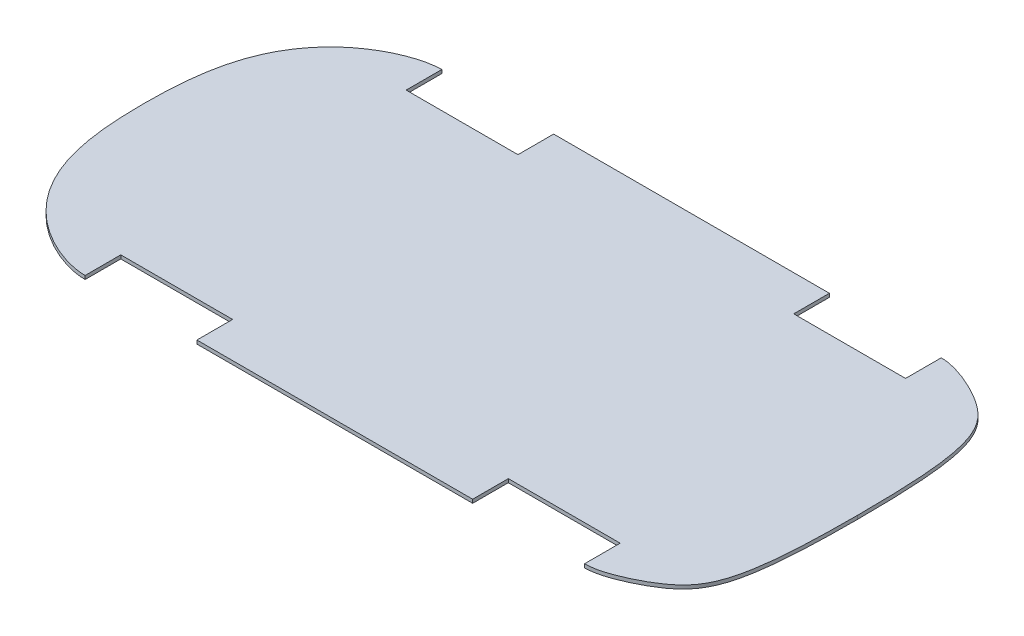
ISO-10303-21;
HEADER;
FILE_DESCRIPTION(('STEP AP214'),'2;1');
FILE_NAME('part.step','',(''),(''),'','','');
FILE_SCHEMA(('AUTOMOTIVE_DESIGN { 1 0 10303 214 1 1 1 1 }'));
ENDSEC;
DATA;
#1=APPLICATION_CONTEXT('core data for automotive mechanical design processes');
#2=APPLICATION_PROTOCOL_DEFINITION('international standard','automotive_design',2000,#1);
#3=PRODUCT_CONTEXT('',#1,'mechanical');
#4=PRODUCT('Part','Part','',(#3));
#5=PRODUCT_RELATED_PRODUCT_CATEGORY('part','',(#4));
#6=PRODUCT_DEFINITION_FORMATION('','',#4);
#7=PRODUCT_DEFINITION_CONTEXT('part definition',#1,'design');
#8=PRODUCT_DEFINITION('design','',#6,#7);
#9=PRODUCT_DEFINITION_SHAPE('','',#8);
#10=(LENGTH_UNIT() NAMED_UNIT(*) SI_UNIT(.MILLI.,.METRE.));
#11=(NAMED_UNIT(*) PLANE_ANGLE_UNIT() SI_UNIT($,.RADIAN.));
#12=(NAMED_UNIT(*) SI_UNIT($,.STERADIAN.) SOLID_ANGLE_UNIT());
#13=UNCERTAINTY_MEASURE_WITH_UNIT(LENGTH_MEASURE(1.E-05),#10,'distance_accuracy_value','');
#14=(GEOMETRIC_REPRESENTATION_CONTEXT(3) GLOBAL_UNCERTAINTY_ASSIGNED_CONTEXT((#13)) GLOBAL_UNIT_ASSIGNED_CONTEXT((#10,
#11,#12)) REPRESENTATION_CONTEXT('',''));
#15=CARTESIAN_POINT('',(0.,0.,0.));
#16=DIRECTION('',(0.,0.,1.));
#17=DIRECTION('',(1.,0.,0.));
#18=AXIS2_PLACEMENT_3D('',#15,#16,#17);
#19=CARTESIAN_POINT('',(1470.04897218709,20.,1000.00002169823));
#20=CARTESIAN_POINT('',(1607.72565016903,20.,1000.0000089803));
#21=CARTESIAN_POINT('',(1776.07388835532,20.,898.779172142014));
#22=CARTESIAN_POINT('',(1902.33506803637,20.,797.558335451434));
#23=CARTESIAN_POINT('',(2000.00004354946,20.,861.100021698231));
#24=CARTESIAN_POINT('',(2000.,20.,-7.49841092362893E-13));
#25=B_SPLINE_CURVE_WITH_KNOTS('',5,(#19,#20,#21,#22,#23,#24),.UNSPECIFIED.,.F.,.F.,(6,6),(0.,
1.),.UNSPECIFIED.);
#26=DIRECTION('',(0.,-1.,0.));
#27=VECTOR('',#26,1.);
#28=SURFACE_OF_LINEAR_EXTRUSION('',#25,#27);
#29=DIRECTION('',(0.,-1.,0.));
#30=VECTOR('',#29,1.);
#31=CARTESIAN_POINT('',(1470.04897218709,20.,1000.00002169823));
#32=LINE('',#31,#30);
#33=CARTESIAN_POINT('',(1470.04897218709,20.,1000.00002169823));
#34=VERTEX_POINT('',#33);
#35=CARTESIAN_POINT('',(1470.04897218709,-0.0001,1000.00002169823));
#36=VERTEX_POINT('',#35);
#37=EDGE_CURVE('E176',#34,#36,#32,.T.);
#38=ORIENTED_EDGE('',*,*,#37,.T.);
#39=CARTESIAN_POINT('',(1470.04897218709,-0.0001,1000.00002169823));
#40=CARTESIAN_POINT('',(1607.72565016903,-0.0001,1000.0000089803));
#41=CARTESIAN_POINT('',(1776.07388835532,-0.0001,898.779172142014));
#42=CARTESIAN_POINT('',(1902.33506803637,-0.0001,797.558335451434));
#43=CARTESIAN_POINT('',(2000.00004354946,-0.0001,861.100021698231));
#44=CARTESIAN_POINT('',(2000.,-0.0001,-7.49841092362893E-13));
#45=B_SPLINE_CURVE_WITH_KNOTS('',5,(#39,#40,#41,#42,#43,#44),.UNSPECIFIED.,.F.,.F.,(6,6),(0.,
1.),.UNSPECIFIED.);
#46=CARTESIAN_POINT('',(2000.,-0.0001,-7.49841092362893E-13));
#47=VERTEX_POINT('',#46);
#48=EDGE_CURVE('E170',#36,#47,#45,.T.);
#49=ORIENTED_EDGE('',*,*,#48,.T.);
#50=DIRECTION('',(0.,-1.,0.));
#51=VECTOR('',#50,1.);
#52=CARTESIAN_POINT('',(2000.,20.,-7.49841092362893E-13));
#53=LINE('',#52,#51);
#54=CARTESIAN_POINT('',(2000.,20.,-7.49841092362893E-13));
#55=VERTEX_POINT('',#54);
#56=EDGE_CURVE('E11',#55,#47,#53,.T.);
#57=ORIENTED_EDGE('',*,*,#56,.F.);
#58=EDGE_CURVE('E243',#34,#55,#25,.T.);
#59=ORIENTED_EDGE('',*,*,#58,.F.);
#60=EDGE_LOOP('',(#38,#49,#57,#59));
#61=FACE_BOUND('',#60,.T.);
#62=ADVANCED_FACE('F33',(#61),#28,.F.);
#63=CARTESIAN_POINT('',(2000.,20.,-7.49841092362893E-13));
#64=CARTESIAN_POINT('',(2000.00004354946,20.,-861.100021698232));
#65=CARTESIAN_POINT('',(1902.33506803637,20.,-797.558335451435));
#66=CARTESIAN_POINT('',(1776.07388835532,20.,-898.779172142016));
#67=CARTESIAN_POINT('',(1607.72565016903,20.,-1000.0000089803));
#68=CARTESIAN_POINT('',(1470.04897218709,20.,-1000.00002169823));
#69=B_SPLINE_CURVE_WITH_KNOTS('',5,(#63,#64,#65,#66,#67,#68),.UNSPECIFIED.,.F.,.F.,(6,6),(0.,
1.),.UNSPECIFIED.);
#70=DIRECTION('',(0.,-1.,0.));
#71=VECTOR('',#70,1.);
#72=SURFACE_OF_LINEAR_EXTRUSION('',#69,#71);
#73=ORIENTED_EDGE('',*,*,#56,.T.);
#74=CARTESIAN_POINT('',(2000.,-0.0001,-7.49841092362893E-13));
#75=CARTESIAN_POINT('',(2000.00004354946,-0.0001,-861.100021698232));
#76=CARTESIAN_POINT('',(1902.33506803637,-0.0001,-797.558335451435));
#77=CARTESIAN_POINT('',(1776.07388835532,-0.0001,-898.779172142016));
#78=CARTESIAN_POINT('',(1607.72565016903,-0.0001,-1000.0000089803));
#79=CARTESIAN_POINT('',(1470.04897218709,-0.0001,-1000.00002169823));
#80=B_SPLINE_CURVE_WITH_KNOTS('',5,(#74,#75,#76,#77,#78,#79),.UNSPECIFIED.,.F.,.F.,(6,6),(0.,
1.),.UNSPECIFIED.);
#81=CARTESIAN_POINT('',(1470.04897218709,-0.0001,-1000.00002169823));
#82=VERTEX_POINT('',#81);
#83=EDGE_CURVE('E160',#47,#82,#80,.T.);
#84=ORIENTED_EDGE('',*,*,#83,.T.);
#85=DIRECTION('',(0.,-1.,0.));
#86=VECTOR('',#85,1.);
#87=CARTESIAN_POINT('',(1470.04897218709,20.,-1000.00002169823));
#88=LINE('',#87,#86);
#89=CARTESIAN_POINT('',(1470.04897218709,20.,-1000.00002169823));
#90=VERTEX_POINT('',#89);
#91=EDGE_CURVE('E41',#90,#82,#88,.T.);
#92=ORIENTED_EDGE('',*,*,#91,.F.);
#93=EDGE_CURVE('E161',#55,#90,#69,.T.);
#94=ORIENTED_EDGE('',*,*,#93,.F.);
#95=EDGE_LOOP('',(#73,#84,#92,#94));
#96=FACE_BOUND('',#95,.T.);
#97=ADVANCED_FACE('F158',(#96),#72,.F.);
#98=CARTESIAN_POINT('',(1470.04897218709,20.,-800.000021698232));
#99=DIRECTION('',(1.,0.,0.));
#100=DIRECTION('',(0.,0.,-1.));
#101=AXIS2_PLACEMENT_3D('',#98,#99,#100);
#102=PLANE('',#101);
#103=ORIENTED_EDGE('',*,*,#91,.T.);
#104=DIRECTION('',(0.,0.,1.));
#105=VECTOR('',#104,1.);
#106=CARTESIAN_POINT('',(1470.04897218709,-0.0001,-800.000021698232));
#107=LINE('',#106,#105);
#108=CARTESIAN_POINT('',(1470.04897218709,-0.0001,-800.000021698232));
#109=VERTEX_POINT('',#108);
#110=EDGE_CURVE('E174',#82,#109,#107,.T.);
#111=ORIENTED_EDGE('',*,*,#110,.T.);
#112=DIRECTION('',(0.,-1.,0.));
#113=VECTOR('',#112,1.);
#114=CARTESIAN_POINT('',(1470.04897218709,20.,-800.000021698232));
#115=LINE('',#114,#113);
#116=CARTESIAN_POINT('',(1470.04897218709,20.,-800.000021698232));
#117=VERTEX_POINT('',#116);
#118=EDGE_CURVE('E357',#117,#109,#115,.T.);
#119=ORIENTED_EDGE('',*,*,#118,.F.);
#120=DIRECTION('',(0.,0.,1.));
#121=VECTOR('',#120,1.);
#122=CARTESIAN_POINT('',(1470.04897218709,20.,-800.000021698232));
#123=LINE('',#122,#121);
#124=EDGE_CURVE('E255',#90,#117,#123,.T.);
#125=ORIENTED_EDGE('',*,*,#124,.F.);
#126=EDGE_LOOP('',(#103,#111,#119,#125));
#127=FACE_BOUND('',#126,.T.);
#128=ADVANCED_FACE('F262',(#127),#102,.F.);
#129=CARTESIAN_POINT('',(843.048972187088,20.,-800.000021698232));
#130=DIRECTION('',(0.,0.,1.));
#131=DIRECTION('',(1.,0.,0.));
#132=AXIS2_PLACEMENT_3D('',#129,#130,#131);
#133=PLANE('',#132);
#134=ORIENTED_EDGE('',*,*,#118,.T.);
#135=DIRECTION('',(-1.,0.,0.));
#136=VECTOR('',#135,1.);
#137=CARTESIAN_POINT('',(843.048972187088,-0.0001,-800.000021698232));
#138=LINE('',#137,#136);
#139=CARTESIAN_POINT('',(843.048972187088,-0.0001,-800.000021698232));
#140=VERTEX_POINT('',#139);
#141=EDGE_CURVE('E190',#109,#140,#138,.T.);
#142=ORIENTED_EDGE('',*,*,#141,.T.);
#143=DIRECTION('',(0.,-1.,0.));
#144=VECTOR('',#143,1.);
#145=CARTESIAN_POINT('',(843.048972187088,20.,-800.000021698232));
#146=LINE('',#145,#144);
#147=CARTESIAN_POINT('',(843.048972187088,20.,-800.000021698232));
#148=VERTEX_POINT('',#147);
#149=EDGE_CURVE('E355',#148,#140,#146,.T.);
#150=ORIENTED_EDGE('',*,*,#149,.F.);
#151=DIRECTION('',(-1.,0.,0.));
#152=VECTOR('',#151,1.);
#153=CARTESIAN_POINT('',(843.048972187088,20.,-800.000021698232));
#154=LINE('',#153,#152);
#155=EDGE_CURVE('E361',#117,#148,#154,.T.);
#156=ORIENTED_EDGE('',*,*,#155,.F.);
#157=EDGE_LOOP('',(#134,#142,#150,#156));
#158=FACE_BOUND('',#157,.T.);
#159=ADVANCED_FACE('F265',(#158),#133,.F.);
#160=CARTESIAN_POINT('',(843.048972187088,20.,-1000.00002169823));
#161=DIRECTION('',(-1.,0.,0.));
#162=DIRECTION('',(0.,0.,1.));
#163=AXIS2_PLACEMENT_3D('',#160,#161,#162);
#164=PLANE('',#163);
#165=ORIENTED_EDGE('',*,*,#149,.T.);
#166=DIRECTION('',(0.,0.,-1.));
#167=VECTOR('',#166,1.);
#168=CARTESIAN_POINT('',(843.048972187088,-0.0001,-1000.00002169823));
#169=LINE('',#168,#167);
#170=CARTESIAN_POINT('',(843.048972187088,-0.0001,-1000.00002169823));
#171=VERTEX_POINT('',#170);
#172=EDGE_CURVE('E193',#140,#171,#169,.T.);
#173=ORIENTED_EDGE('',*,*,#172,.T.);
#174=DIRECTION('',(0.,-1.,0.));
#175=VECTOR('',#174,1.);
#176=CARTESIAN_POINT('',(843.048972187088,20.,-1000.00002169823));
#177=LINE('',#176,#175);
#178=CARTESIAN_POINT('',(843.048972187088,20.,-1000.00002169823));
#179=VERTEX_POINT('',#178);
#180=EDGE_CURVE('E353',#179,#171,#177,.T.);
#181=ORIENTED_EDGE('',*,*,#180,.F.);
#182=DIRECTION('',(0.,0.,-1.));
#183=VECTOR('',#182,1.);
#184=CARTESIAN_POINT('',(843.048972187088,20.,-1000.00002169823));
#185=LINE('',#184,#183);
#186=EDGE_CURVE('E362',#148,#179,#185,.T.);
#187=ORIENTED_EDGE('',*,*,#186,.F.);
#188=EDGE_LOOP('',(#165,#173,#181,#187));
#189=FACE_BOUND('',#188,.T.);
#190=ADVANCED_FACE('F269',(#189),#164,.F.);
#191=CARTESIAN_POINT('',(-702.951027812912,20.,-1000.00002169823));
#192=DIRECTION('',(0.,0.,1.));
#193=DIRECTION('',(1.,0.,0.));
#194=AXIS2_PLACEMENT_3D('',#191,#192,#193);
#195=PLANE('',#194);
#196=ORIENTED_EDGE('',*,*,#180,.T.);
#197=DIRECTION('',(-1.,0.,0.));
#198=VECTOR('',#197,1.);
#199=CARTESIAN_POINT('',(-702.951027812912,-0.0001,-1000.00002169823));
#200=LINE('',#199,#198);
#201=CARTESIAN_POINT('',(-702.951027812912,-0.0001,-1000.00002169823));
#202=VERTEX_POINT('',#201);
#203=EDGE_CURVE('E196',#171,#202,#200,.T.);
#204=ORIENTED_EDGE('',*,*,#203,.T.);
#205=DIRECTION('',(0.,-1.,0.));
#206=VECTOR('',#205,1.);
#207=CARTESIAN_POINT('',(-702.951027812912,20.,-1000.00002169823));
#208=LINE('',#207,#206);
#209=CARTESIAN_POINT('',(-702.951027812912,20.,-1000.00002169823));
#210=VERTEX_POINT('',#209);
#211=EDGE_CURVE('E351',#210,#202,#208,.T.);
#212=ORIENTED_EDGE('',*,*,#211,.F.);
#213=DIRECTION('',(-1.,0.,0.));
#214=VECTOR('',#213,1.);
#215=CARTESIAN_POINT('',(-702.951027812912,20.,-1000.00002169823));
#216=LINE('',#215,#214);
#217=EDGE_CURVE('E364',#179,#210,#216,.T.);
#218=ORIENTED_EDGE('',*,*,#217,.F.);
#219=EDGE_LOOP('',(#196,#204,#212,#218));
#220=FACE_BOUND('',#219,.T.);
#221=ADVANCED_FACE('F273',(#220),#195,.F.);
#222=CARTESIAN_POINT('',(-702.951027812912,20.,-800.000021698232));
#223=DIRECTION('',(1.,0.,0.));
#224=DIRECTION('',(0.,0.,-1.));
#225=AXIS2_PLACEMENT_3D('',#222,#223,#224);
#226=PLANE('',#225);
#227=ORIENTED_EDGE('',*,*,#211,.T.);
#228=DIRECTION('',(0.,0.,1.));
#229=VECTOR('',#228,1.);
#230=CARTESIAN_POINT('',(-702.951027812912,-0.0001,-800.000021698232));
#231=LINE('',#230,#229);
#232=CARTESIAN_POINT('',(-702.951027812912,-0.0001,-800.000021698232));
#233=VERTEX_POINT('',#232);
#234=EDGE_CURVE('E199',#202,#233,#231,.T.);
#235=ORIENTED_EDGE('',*,*,#234,.T.);
#236=DIRECTION('',(0.,-1.,0.));
#237=VECTOR('',#236,1.);
#238=CARTESIAN_POINT('',(-702.951027812912,20.,-800.000021698232));
#239=LINE('',#238,#237);
#240=CARTESIAN_POINT('',(-702.951027812912,20.,-800.000021698232));
#241=VERTEX_POINT('',#240);
#242=EDGE_CURVE('E349',#241,#233,#239,.T.);
#243=ORIENTED_EDGE('',*,*,#242,.F.);
#244=DIRECTION('',(0.,0.,1.));
#245=VECTOR('',#244,1.);
#246=CARTESIAN_POINT('',(-702.951027812912,20.,-800.000021698232));
#247=LINE('',#246,#245);
#248=EDGE_CURVE('E368',#210,#241,#247,.T.);
#249=ORIENTED_EDGE('',*,*,#248,.F.);
#250=EDGE_LOOP('',(#227,#235,#243,#249));
#251=FACE_BOUND('',#250,.T.);
#252=ADVANCED_FACE('F277',(#251),#226,.F.);
#253=CARTESIAN_POINT('',(-1329.95102781291,20.,-800.000021698232));
#254=DIRECTION('',(0.,0.,1.));
#255=DIRECTION('',(1.,0.,0.));
#256=AXIS2_PLACEMENT_3D('',#253,#254,#255);
#257=PLANE('',#256);
#258=ORIENTED_EDGE('',*,*,#242,.T.);
#259=DIRECTION('',(-1.,0.,0.));
#260=VECTOR('',#259,1.);
#261=CARTESIAN_POINT('',(-1329.95102781291,-0.0001,-800.000021698232));
#262=LINE('',#261,#260);
#263=CARTESIAN_POINT('',(-1329.95102781291,-0.0001,-800.000021698232));
#264=VERTEX_POINT('',#263);
#265=EDGE_CURVE('E202',#233,#264,#262,.T.);
#266=ORIENTED_EDGE('',*,*,#265,.T.);
#267=DIRECTION('',(0.,-1.,0.));
#268=VECTOR('',#267,1.);
#269=CARTESIAN_POINT('',(-1329.95102781291,20.,-800.000021698232));
#270=LINE('',#269,#268);
#271=CARTESIAN_POINT('',(-1329.95102781291,20.,-800.000021698232));
#272=VERTEX_POINT('',#271);
#273=EDGE_CURVE('E347',#272,#264,#270,.T.);
#274=ORIENTED_EDGE('',*,*,#273,.F.);
#275=DIRECTION('',(-1.,0.,0.));
#276=VECTOR('',#275,1.);
#277=CARTESIAN_POINT('',(-1329.95102781291,20.,-800.000021698232));
#278=LINE('',#277,#276);
#279=EDGE_CURVE('E369',#241,#272,#278,.T.);
#280=ORIENTED_EDGE('',*,*,#279,.F.);
#281=EDGE_LOOP('',(#258,#266,#274,#280));
#282=FACE_BOUND('',#281,.T.);
#283=ADVANCED_FACE('F281',(#282),#257,.F.);
#284=CARTESIAN_POINT('',(-1329.95102781291,20.,-1000.00002169823));
#285=DIRECTION('',(-1.,0.,0.));
#286=DIRECTION('',(0.,0.,1.));
#287=AXIS2_PLACEMENT_3D('',#284,#285,#286);
#288=PLANE('',#287);
#289=ORIENTED_EDGE('',*,*,#273,.T.);
#290=DIRECTION('',(0.,0.,-1.));
#291=VECTOR('',#290,1.);
#292=CARTESIAN_POINT('',(-1329.95102781291,-0.0001,-1000.00002169823));
#293=LINE('',#292,#291);
#294=CARTESIAN_POINT('',(-1329.95102781291,-0.0001,-1000.00002169823));
#295=VERTEX_POINT('',#294);
#296=EDGE_CURVE('E205',#264,#295,#293,.T.);
#297=ORIENTED_EDGE('',*,*,#296,.T.);
#298=DIRECTION('',(0.,-1.,0.));
#299=VECTOR('',#298,1.);
#300=CARTESIAN_POINT('',(-1329.95102781291,20.,-1000.00002169823));
#301=LINE('',#300,#299);
#302=CARTESIAN_POINT('',(-1329.95102781291,20.,-1000.00002169823));
#303=VERTEX_POINT('',#302);
#304=EDGE_CURVE('E345',#303,#295,#301,.T.);
#305=ORIENTED_EDGE('',*,*,#304,.F.);
#306=DIRECTION('',(0.,0.,-1.));
#307=VECTOR('',#306,1.);
#308=CARTESIAN_POINT('',(-1329.95102781291,20.,-1000.00002169823));
#309=LINE('',#308,#307);
#310=EDGE_CURVE('E304',#272,#303,#309,.T.);
#311=ORIENTED_EDGE('',*,*,#310,.F.);
#312=EDGE_LOOP('',(#289,#297,#305,#311));
#313=FACE_BOUND('',#312,.T.);
#314=ADVANCED_FACE('F285',(#313),#288,.F.);
#315=CARTESIAN_POINT('',(-1329.95102781291,20.,-1000.00002169823));
#316=CARTESIAN_POINT('',(-1481.46449430946,20.,-1000.00004432143));
#317=CARTESIAN_POINT('',(-1750.82167957359,20.,-890.149892656102));
#318=CARTESIAN_POINT('',(-1927.58733268781,20.,-679.714589853758));
#319=CARTESIAN_POINT('',(-2000.00004067059,20.,-444.027050350482));
#320=CARTESIAN_POINT('',(-2000.,20.,4.7480570678446E-13));
#321=B_SPLINE_CURVE_WITH_KNOTS('',5,(#315,#316,#317,#318,#319,#320),.UNSPECIFIED.,.F.,.F.,(6,6),
(0.,1.),.UNSPECIFIED.);
#322=DIRECTION('',(0.,-1.,0.));
#323=VECTOR('',#322,1.);
#324=SURFACE_OF_LINEAR_EXTRUSION('',#321,#323);
#325=ORIENTED_EDGE('',*,*,#304,.T.);
#326=CARTESIAN_POINT('',(-1329.95102781291,-0.0001,-1000.00002169823));
#327=CARTESIAN_POINT('',(-1481.46449430946,-0.0001,-1000.00004432143));
#328=CARTESIAN_POINT('',(-1750.82167957359,-0.0001,-890.149892656102));
#329=CARTESIAN_POINT('',(-1927.58733268781,-0.0001,-679.714589853758));
#330=CARTESIAN_POINT('',(-2000.00004067059,-0.0001,-444.027050350482));
#331=CARTESIAN_POINT('',(-2000.,-0.0001,4.7480570678446E-13));
#332=B_SPLINE_CURVE_WITH_KNOTS('',5,(#326,#327,#328,#329,#330,#331),.UNSPECIFIED.,.F.,.F.,(6,6),
(0.,1.),.UNSPECIFIED.);
#333=CARTESIAN_POINT('',(-2000.,-0.0001,4.7480570678446E-13));
#334=VERTEX_POINT('',#333);
#335=EDGE_CURVE('E208',#295,#334,#332,.T.);
#336=ORIENTED_EDGE('',*,*,#335,.T.);
#337=DIRECTION('',(0.,-1.,0.));
#338=VECTOR('',#337,1.);
#339=CARTESIAN_POINT('',(-2000.,20.,4.7480570678446E-13));
#340=LINE('',#339,#338);
#341=CARTESIAN_POINT('',(-2000.,20.,4.7480570678446E-13));
#342=VERTEX_POINT('',#341);
#343=EDGE_CURVE('E343',#342,#334,#340,.T.);
#344=ORIENTED_EDGE('',*,*,#343,.F.);
#345=EDGE_CURVE('E298',#303,#342,#321,.T.);
#346=ORIENTED_EDGE('',*,*,#345,.F.);
#347=EDGE_LOOP('',(#325,#336,#344,#346));
#348=FACE_BOUND('',#347,.T.);
#349=ADVANCED_FACE('F289',(#348),#324,.F.);
#350=CARTESIAN_POINT('',(-2000.,20.,4.7480570678446E-13));
#351=CARTESIAN_POINT('',(-2000.00004067059,20.,444.027050350483));
#352=CARTESIAN_POINT('',(-1927.58733268781,20.,679.714589853759));
#353=CARTESIAN_POINT('',(-1750.82167957359,20.,890.149892656103));
#354=CARTESIAN_POINT('',(-1481.46449430946,20.,1000.00004432143));
#355=CARTESIAN_POINT('',(-1329.95102781291,20.,1000.00002169823));
#356=B_SPLINE_CURVE_WITH_KNOTS('',5,(#350,#351,#352,#353,#354,#355),.UNSPECIFIED.,.F.,.F.,(6,6),
(0.,1.),.UNSPECIFIED.);
#357=DIRECTION('',(0.,-1.,0.));
#358=VECTOR('',#357,1.);
#359=SURFACE_OF_LINEAR_EXTRUSION('',#356,#358);
#360=ORIENTED_EDGE('',*,*,#343,.T.);
#361=CARTESIAN_POINT('',(-2000.,-0.0001,4.7480570678446E-13));
#362=CARTESIAN_POINT('',(-2000.00004067059,-0.0001,444.027050350483));
#363=CARTESIAN_POINT('',(-1927.58733268781,-0.0001,679.714589853759));
#364=CARTESIAN_POINT('',(-1750.82167957359,-0.0001,890.149892656103));
#365=CARTESIAN_POINT('',(-1481.46449430946,-0.0001,1000.00004432143));
#366=CARTESIAN_POINT('',(-1329.95102781291,-0.0001,1000.00002169823));
#367=B_SPLINE_CURVE_WITH_KNOTS('',5,(#361,#362,#363,#364,#365,#366),.UNSPECIFIED.,.F.,.F.,(6,6),
(0.,1.),.UNSPECIFIED.);
#368=CARTESIAN_POINT('',(-1329.95102781291,-0.0001,1000.00002169823));
#369=VERTEX_POINT('',#368);
#370=EDGE_CURVE('E213',#334,#369,#367,.T.);
#371=ORIENTED_EDGE('',*,*,#370,.T.);
#372=DIRECTION('',(0.,-1.,0.));
#373=VECTOR('',#372,1.);
#374=CARTESIAN_POINT('',(-1329.95102781291,20.,1000.00002169823));
#375=LINE('',#374,#373);
#376=CARTESIAN_POINT('',(-1329.95102781291,20.,1000.00002169823));
#377=VERTEX_POINT('',#376);
#378=EDGE_CURVE('E341',#377,#369,#375,.T.);
#379=ORIENTED_EDGE('',*,*,#378,.F.);
#380=EDGE_CURVE('E303',#342,#377,#356,.T.);
#381=ORIENTED_EDGE('',*,*,#380,.F.);
#382=EDGE_LOOP('',(#360,#371,#379,#381));
#383=FACE_BOUND('',#382,.T.);
#384=ADVANCED_FACE('F294',(#383),#359,.F.);
#385=CARTESIAN_POINT('',(-1329.95102781291,20.,1000.00002169823));
#386=DIRECTION('',(-1.,0.,0.));
#387=DIRECTION('',(0.,0.,1.));
#388=AXIS2_PLACEMENT_3D('',#385,#386,#387);
#389=PLANE('',#388);
#390=ORIENTED_EDGE('',*,*,#378,.T.);
#391=DIRECTION('',(0.,0.,-1.));
#392=VECTOR('',#391,1.);
#393=CARTESIAN_POINT('',(-1329.95102781291,-0.0001,1000.00002169823));
#394=LINE('',#393,#392);
#395=CARTESIAN_POINT('',(-1329.95102781291,-0.0001,800.000021698233));
#396=VERTEX_POINT('',#395);
#397=EDGE_CURVE('E221',#369,#396,#394,.T.);
#398=ORIENTED_EDGE('',*,*,#397,.T.);
#399=DIRECTION('',(0.,-1.,0.));
#400=VECTOR('',#399,1.);
#401=CARTESIAN_POINT('',(-1329.95102781291,20.,800.000021698233));
#402=LINE('',#401,#400);
#403=CARTESIAN_POINT('',(-1329.95102781291,20.,800.000021698233));
#404=VERTEX_POINT('',#403);
#405=EDGE_CURVE('E339',#404,#396,#402,.T.);
#406=ORIENTED_EDGE('',*,*,#405,.F.);
#407=DIRECTION('',(0.,0.,-1.));
#408=VECTOR('',#407,1.);
#409=CARTESIAN_POINT('',(-1329.95102781291,20.,1000.00002169823));
#410=LINE('',#409,#408);
#411=EDGE_CURVE('E313',#377,#404,#410,.T.);
#412=ORIENTED_EDGE('',*,*,#411,.F.);
#413=EDGE_LOOP('',(#390,#398,#406,#412));
#414=FACE_BOUND('',#413,.T.);
#415=ADVANCED_FACE('F388',(#414),#389,.F.);
#416=CARTESIAN_POINT('',(-1329.95102781291,20.,800.000021698233));
#417=DIRECTION('',(0.,0.,-1.));
#418=DIRECTION('',(-1.,0.,0.));
#419=AXIS2_PLACEMENT_3D('',#416,#417,#418);
#420=PLANE('',#419);
#421=ORIENTED_EDGE('',*,*,#405,.T.);
#422=DIRECTION('',(1.,0.,0.));
#423=VECTOR('',#422,1.);
#424=CARTESIAN_POINT('',(-1329.95102781291,-0.0001,800.000021698233));
#425=LINE('',#424,#423);
#426=CARTESIAN_POINT('',(-702.951027812911,-0.0001,800.000021698232));
#427=VERTEX_POINT('',#426);
#428=EDGE_CURVE('E227',#396,#427,#425,.T.);
#429=ORIENTED_EDGE('',*,*,#428,.T.);
#430=DIRECTION('',(0.,-1.,0.));
#431=VECTOR('',#430,1.);
#432=CARTESIAN_POINT('',(-702.951027812911,20.,800.000021698232));
#433=LINE('',#432,#431);
#434=CARTESIAN_POINT('',(-702.951027812911,20.,800.000021698232));
#435=VERTEX_POINT('',#434);
#436=EDGE_CURVE('E337',#435,#427,#433,.T.);
#437=ORIENTED_EDGE('',*,*,#436,.F.);
#438=DIRECTION('',(1.,0.,0.));
#439=VECTOR('',#438,1.);
#440=CARTESIAN_POINT('',(-1329.95102781291,20.,800.000021698233));
#441=LINE('',#440,#439);
#442=EDGE_CURVE('E318',#404,#435,#441,.T.);
#443=ORIENTED_EDGE('',*,*,#442,.F.);
#444=EDGE_LOOP('',(#421,#429,#437,#443));
#445=FACE_BOUND('',#444,.T.);
#446=ADVANCED_FACE('F392',(#445),#420,.F.);
#447=CARTESIAN_POINT('',(-702.951027812911,20.,800.000021698232));
#448=DIRECTION('',(1.,0.,0.));
#449=DIRECTION('',(0.,0.,-1.));
#450=AXIS2_PLACEMENT_3D('',#447,#448,#449);
#451=PLANE('',#450);
#452=ORIENTED_EDGE('',*,*,#436,.T.);
#453=DIRECTION('',(0.,0.,1.));
#454=VECTOR('',#453,1.);
#455=CARTESIAN_POINT('',(-702.951027812911,-0.0001,800.000021698232));
#456=LINE('',#455,#454);
#457=CARTESIAN_POINT('',(-702.951027812911,-0.0001,1000.00002169823));
#458=VERTEX_POINT('',#457);
#459=EDGE_CURVE('E230',#427,#458,#456,.T.);
#460=ORIENTED_EDGE('',*,*,#459,.T.);
#461=DIRECTION('',(0.,-1.,0.));
#462=VECTOR('',#461,1.);
#463=CARTESIAN_POINT('',(-702.951027812911,20.,1000.00002169823));
#464=LINE('',#463,#462);
#465=CARTESIAN_POINT('',(-702.951027812911,20.,1000.00002169823));
#466=VERTEX_POINT('',#465);
#467=EDGE_CURVE('E335',#466,#458,#464,.T.);
#468=ORIENTED_EDGE('',*,*,#467,.F.);
#469=DIRECTION('',(0.,0.,1.));
#470=VECTOR('',#469,1.);
#471=CARTESIAN_POINT('',(-702.951027812911,20.,800.000021698232));
#472=LINE('',#471,#470);
#473=EDGE_CURVE('E320',#435,#466,#472,.T.);
#474=ORIENTED_EDGE('',*,*,#473,.F.);
#475=EDGE_LOOP('',(#452,#460,#468,#474));
#476=FACE_BOUND('',#475,.T.);
#477=ADVANCED_FACE('F397',(#476),#451,.F.);
#478=CARTESIAN_POINT('',(-702.951027812911,20.,1000.00002169823));
#479=DIRECTION('',(0.,0.,-1.));
#480=DIRECTION('',(-1.,0.,0.));
#481=AXIS2_PLACEMENT_3D('',#478,#479,#480);
#482=PLANE('',#481);
#483=ORIENTED_EDGE('',*,*,#467,.T.);
#484=DIRECTION('',(1.,0.,0.));
#485=VECTOR('',#484,1.);
#486=CARTESIAN_POINT('',(-702.951027812911,-0.0001,1000.00002169823));
#487=LINE('',#486,#485);
#488=CARTESIAN_POINT('',(843.048972187088,-0.0001,1000.00002169823));
#489=VERTEX_POINT('',#488);
#490=EDGE_CURVE('E233',#458,#489,#487,.T.);
#491=ORIENTED_EDGE('',*,*,#490,.T.);
#492=DIRECTION('',(0.,-1.,0.));
#493=VECTOR('',#492,1.);
#494=CARTESIAN_POINT('',(843.048972187088,20.,1000.00002169823));
#495=LINE('',#494,#493);
#496=CARTESIAN_POINT('',(843.048972187088,20.,1000.00002169823));
#497=VERTEX_POINT('',#496);
#498=EDGE_CURVE('E333',#497,#489,#495,.T.);
#499=ORIENTED_EDGE('',*,*,#498,.F.);
#500=DIRECTION('',(1.,0.,0.));
#501=VECTOR('',#500,1.);
#502=CARTESIAN_POINT('',(-702.951027812911,20.,1000.00002169823));
#503=LINE('',#502,#501);
#504=EDGE_CURVE('E322',#466,#497,#503,.T.);
#505=ORIENTED_EDGE('',*,*,#504,.F.);
#506=EDGE_LOOP('',(#483,#491,#499,#505));
#507=FACE_BOUND('',#506,.T.);
#508=ADVANCED_FACE('F403',(#507),#482,.F.);
#509=CARTESIAN_POINT('',(843.048972187088,20.,1000.00002169823));
#510=DIRECTION('',(-1.,0.,0.));
#511=DIRECTION('',(0.,0.,1.));
#512=AXIS2_PLACEMENT_3D('',#509,#510,#511);
#513=PLANE('',#512);
#514=ORIENTED_EDGE('',*,*,#498,.T.);
#515=DIRECTION('',(0.,0.,-1.));
#516=VECTOR('',#515,1.);
#517=CARTESIAN_POINT('',(843.048972187088,-0.0001,1000.00002169823));
#518=LINE('',#517,#516);
#519=CARTESIAN_POINT('',(843.048972187088,-0.0001,800.000021698231));
#520=VERTEX_POINT('',#519);
#521=EDGE_CURVE('E236',#489,#520,#518,.T.);
#522=ORIENTED_EDGE('',*,*,#521,.T.);
#523=DIRECTION('',(0.,-1.,0.));
#524=VECTOR('',#523,1.);
#525=CARTESIAN_POINT('',(843.048972187088,20.,800.000021698231));
#526=LINE('',#525,#524);
#527=CARTESIAN_POINT('',(843.048972187088,20.,800.000021698231));
#528=VERTEX_POINT('',#527);
#529=EDGE_CURVE('E331',#528,#520,#526,.T.);
#530=ORIENTED_EDGE('',*,*,#529,.F.);
#531=DIRECTION('',(0.,0.,-1.));
#532=VECTOR('',#531,1.);
#533=CARTESIAN_POINT('',(843.048972187088,20.,1000.00002169823));
#534=LINE('',#533,#532);
#535=EDGE_CURVE('E324',#497,#528,#534,.T.);
#536=ORIENTED_EDGE('',*,*,#535,.F.);
#537=EDGE_LOOP('',(#514,#522,#530,#536));
#538=FACE_BOUND('',#537,.T.);
#539=ADVANCED_FACE('F407',(#538),#513,.F.);
#540=CARTESIAN_POINT('',(843.048972187088,20.,800.000021698231));
#541=DIRECTION('',(0.,0.,-1.));
#542=DIRECTION('',(-1.,0.,0.));
#543=AXIS2_PLACEMENT_3D('',#540,#541,#542);
#544=PLANE('',#543);
#545=ORIENTED_EDGE('',*,*,#529,.T.);
#546=DIRECTION('',(1.,0.,0.));
#547=VECTOR('',#546,1.);
#548=CARTESIAN_POINT('',(843.048972187088,-0.0001,800.000021698231));
#549=LINE('',#548,#547);
#550=CARTESIAN_POINT('',(1470.04897218709,-0.0001,800.000021698231));
#551=VERTEX_POINT('',#550);
#552=EDGE_CURVE('E239',#520,#551,#549,.T.);
#553=ORIENTED_EDGE('',*,*,#552,.T.);
#554=DIRECTION('',(0.,-1.,0.));
#555=VECTOR('',#554,1.);
#556=CARTESIAN_POINT('',(1470.04897218709,20.,800.000021698231));
#557=LINE('',#556,#555);
#558=CARTESIAN_POINT('',(1470.04897218709,20.,800.000021698231));
#559=VERTEX_POINT('',#558);
#560=EDGE_CURVE('E329',#559,#551,#557,.T.);
#561=ORIENTED_EDGE('',*,*,#560,.F.);
#562=DIRECTION('',(1.,0.,0.));
#563=VECTOR('',#562,1.);
#564=CARTESIAN_POINT('',(843.048972187088,20.,800.000021698231));
#565=LINE('',#564,#563);
#566=EDGE_CURVE('E53',#528,#559,#565,.T.);
#567=ORIENTED_EDGE('',*,*,#566,.F.);
#568=EDGE_LOOP('',(#545,#553,#561,#567));
#569=FACE_BOUND('',#568,.T.);
#570=ADVANCED_FACE('F410',(#569),#544,.F.);
#571=CARTESIAN_POINT('',(1470.04897218709,20.,800.000021698231));
#572=DIRECTION('',(1.,0.,0.));
#573=DIRECTION('',(0.,0.,-1.));
#574=AXIS2_PLACEMENT_3D('',#571,#572,#573);
#575=PLANE('',#574);
#576=ORIENTED_EDGE('',*,*,#560,.T.);
#577=DIRECTION('',(0.,0.,1.));
#578=VECTOR('',#577,1.);
#579=CARTESIAN_POINT('',(1470.04897218709,-0.0001,800.000021698231));
#580=LINE('',#579,#578);
#581=EDGE_CURVE('E242',#551,#36,#580,.T.);
#582=ORIENTED_EDGE('',*,*,#581,.T.);
#583=ORIENTED_EDGE('',*,*,#37,.F.);
#584=DIRECTION('',(0.,0.,1.));
#585=VECTOR('',#584,1.);
#586=CARTESIAN_POINT('',(1470.04897218709,20.,800.000021698231));
#587=LINE('',#586,#585);
#588=EDGE_CURVE('E48',#559,#34,#587,.T.);
#589=ORIENTED_EDGE('',*,*,#588,.F.);
#590=EDGE_LOOP('',(#576,#582,#583,#589));
#591=FACE_BOUND('',#590,.T.);
#592=ADVANCED_FACE('F412',(#591),#575,.F.);
#593=CARTESIAN_POINT('',(1821.64896889676,20.,852.152351594542));
#594=DIRECTION('',(0.,-1.,0.));
#595=DIRECTION('',(0.,0.,-1.));
#596=AXIS2_PLACEMENT_3D('',#593,#594,#595);
#597=PLANE('',#596);
#598=ORIENTED_EDGE('',*,*,#58,.T.);
#599=ORIENTED_EDGE('',*,*,#93,.T.);
#600=ORIENTED_EDGE('',*,*,#124,.T.);
#601=ORIENTED_EDGE('',*,*,#155,.T.);
#602=ORIENTED_EDGE('',*,*,#186,.T.);
#603=ORIENTED_EDGE('',*,*,#217,.T.);
#604=ORIENTED_EDGE('',*,*,#248,.T.);
#605=ORIENTED_EDGE('',*,*,#279,.T.);
#606=ORIENTED_EDGE('',*,*,#310,.T.);
#607=ORIENTED_EDGE('',*,*,#345,.T.);
#608=ORIENTED_EDGE('',*,*,#380,.T.);
#609=ORIENTED_EDGE('',*,*,#411,.T.);
#610=ORIENTED_EDGE('',*,*,#442,.T.);
#611=ORIENTED_EDGE('',*,*,#473,.T.);
#612=ORIENTED_EDGE('',*,*,#504,.T.);
#613=ORIENTED_EDGE('',*,*,#535,.T.);
#614=ORIENTED_EDGE('',*,*,#566,.T.);
#615=ORIENTED_EDGE('',*,*,#588,.T.);
#616=EDGE_LOOP('',(#598,#599,#600,#601,#602,#603,#604,#605,#606,#607,#608,#609,#610,#611,#612,
#613,#614,#615));
#617=FACE_BOUND('',#616,.T.);
#618=ADVANCED_FACE('F374',(#617),#597,.F.);
#619=CARTESIAN_POINT('',(1821.64896889676,-0.0001,852.152351594542));
#620=DIRECTION('',(0.,-1.,0.));
#621=DIRECTION('',(0.,0.,-1.));
#622=AXIS2_PLACEMENT_3D('',#619,#620,#621);
#623=PLANE('',#622);
#624=ORIENTED_EDGE('',*,*,#48,.F.);
#625=ORIENTED_EDGE('',*,*,#581,.F.);
#626=ORIENTED_EDGE('',*,*,#552,.F.);
#627=ORIENTED_EDGE('',*,*,#521,.F.);
#628=ORIENTED_EDGE('',*,*,#490,.F.);
#629=ORIENTED_EDGE('',*,*,#459,.F.);
#630=ORIENTED_EDGE('',*,*,#428,.F.);
#631=ORIENTED_EDGE('',*,*,#397,.F.);
#632=ORIENTED_EDGE('',*,*,#370,.F.);
#633=ORIENTED_EDGE('',*,*,#335,.F.);
#634=ORIENTED_EDGE('',*,*,#296,.F.);
#635=ORIENTED_EDGE('',*,*,#265,.F.);
#636=ORIENTED_EDGE('',*,*,#234,.F.);
#637=ORIENTED_EDGE('',*,*,#203,.F.);
#638=ORIENTED_EDGE('',*,*,#172,.F.);
#639=ORIENTED_EDGE('',*,*,#141,.F.);
#640=ORIENTED_EDGE('',*,*,#110,.F.);
#641=ORIENTED_EDGE('',*,*,#83,.F.);
#642=EDGE_LOOP('',(#624,#625,#626,#627,#628,#629,#630,#631,#632,#633,#634,#635,#636,#637,#638,
#639,#640,#641));
#643=FACE_BOUND('',#642,.T.);
#644=ADVANCED_FACE('F168',(#643),#623,.T.);
#645=CLOSED_SHELL('',(#62,#97,#128,#159,#190,#221,#252,#283,#314,#349,#384,#415,#446,#477,#508,
#539,#570,#592,#618,#644));
#646=MANIFOLD_SOLID_BREP('B2',#645);
#647=ADVANCED_BREP_SHAPE_REPRESENTATION('',(#18,#646),#14);
#648=SHAPE_DEFINITION_REPRESENTATION(#9,#647);
ENDSEC;
END-ISO-10303-21;
